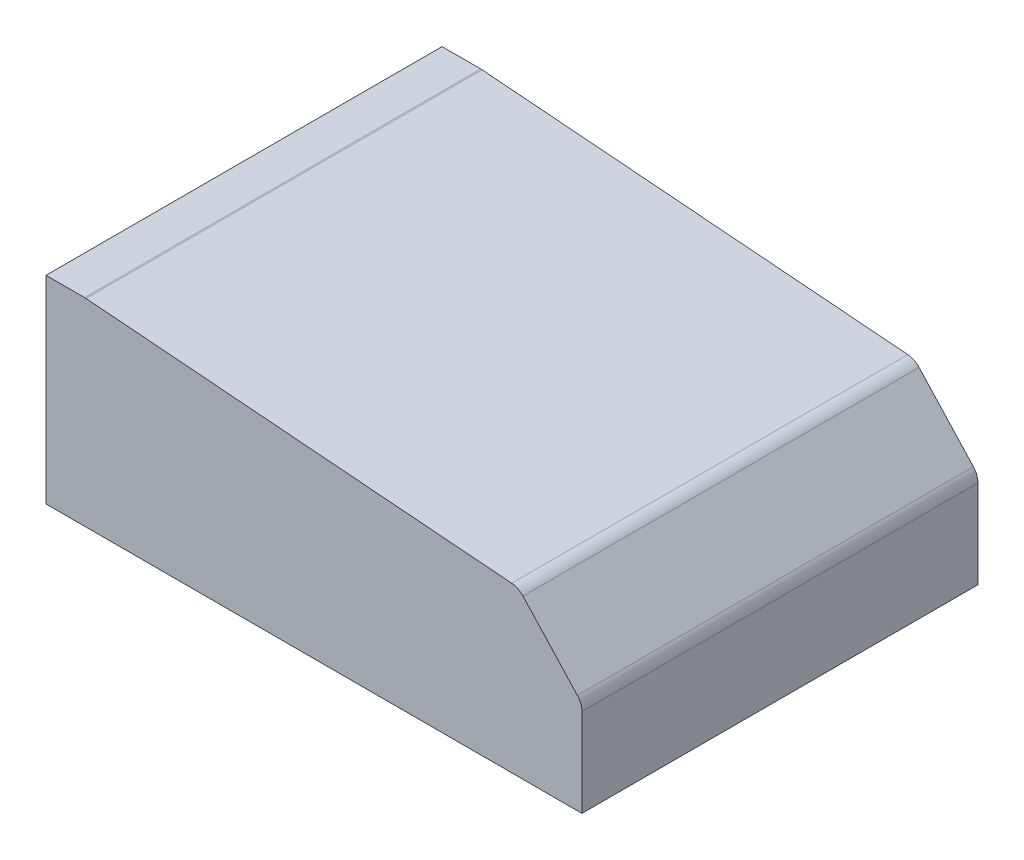
ISO-10303-21;
HEADER;
FILE_DESCRIPTION(('STEP AP214'),'2;1');
FILE_NAME('part.step','',(''),(''),'','','');
FILE_SCHEMA(('AUTOMOTIVE_DESIGN { 1 0 10303 214 1 1 1 1 }'));
ENDSEC;
DATA;
#1=APPLICATION_CONTEXT('core data for automotive mechanical design processes');
#2=APPLICATION_PROTOCOL_DEFINITION('international standard','automotive_design',2000,#1);
#3=PRODUCT_CONTEXT('',#1,'mechanical');
#4=PRODUCT('Part','Part','',(#3));
#5=PRODUCT_RELATED_PRODUCT_CATEGORY('part','',(#4));
#6=PRODUCT_DEFINITION_FORMATION('','',#4);
#7=PRODUCT_DEFINITION_CONTEXT('part definition',#1,'design');
#8=PRODUCT_DEFINITION('design','',#6,#7);
#9=PRODUCT_DEFINITION_SHAPE('','',#8);
#10=(LENGTH_UNIT() NAMED_UNIT(*) SI_UNIT(.MILLI.,.METRE.));
#11=(NAMED_UNIT(*) PLANE_ANGLE_UNIT() SI_UNIT($,.RADIAN.));
#12=(NAMED_UNIT(*) SI_UNIT($,.STERADIAN.) SOLID_ANGLE_UNIT());
#13=UNCERTAINTY_MEASURE_WITH_UNIT(LENGTH_MEASURE(1.E-05),#10,'distance_accuracy_value','');
#14=(GEOMETRIC_REPRESENTATION_CONTEXT(3) GLOBAL_UNCERTAINTY_ASSIGNED_CONTEXT((#13)) GLOBAL_UNIT_ASSIGNED_CONTEXT((#10,
#11,#12)) REPRESENTATION_CONTEXT('',''));
#15=CARTESIAN_POINT('',(0.,0.,0.));
#16=DIRECTION('',(0.,0.,1.));
#17=DIRECTION('',(1.,0.,0.));
#18=AXIS2_PLACEMENT_3D('',#15,#16,#17);
#19=CARTESIAN_POINT('',(0.,0.,504.));
#20=DIRECTION('',(1.,0.,0.));
#21=DIRECTION('',(0.,0.,-1.));
#22=AXIS2_PLACEMENT_3D('',#19,#20,#21);
#23=PLANE('',#22);
#24=DIRECTION('',(0.,-1.,0.));
#25=VECTOR('',#24,1.);
#26=CARTESIAN_POINT('',(0.,0.,2.));
#27=LINE('',#26,#25);
#28=CARTESIAN_POINT('',(0.,250.,2.));
#29=VERTEX_POINT('',#28);
#30=CARTESIAN_POINT('',(0.,0.,2.));
#31=VERTEX_POINT('',#30);
#32=EDGE_CURVE('E229',#29,#31,#27,.T.);
#33=ORIENTED_EDGE('',*,*,#32,.F.);
#34=DIRECTION('',(0.,0.,-1.));
#35=VECTOR('',#34,1.);
#36=CARTESIAN_POINT('',(0.,250.,504.));
#37=LINE('',#36,#35);
#38=CARTESIAN_POINT('',(0.,250.,502.));
#39=VERTEX_POINT('',#38);
#40=EDGE_CURVE('E223',#39,#29,#37,.T.);
#41=ORIENTED_EDGE('',*,*,#40,.F.);
#42=DIRECTION('',(0.,-1.,0.));
#43=VECTOR('',#42,1.);
#44=CARTESIAN_POINT('',(0.,0.,502.));
#45=LINE('',#44,#43);
#46=CARTESIAN_POINT('',(0.,0.,502.));
#47=VERTEX_POINT('',#46);
#48=EDGE_CURVE('E141',#39,#47,#45,.T.);
#49=ORIENTED_EDGE('',*,*,#48,.T.);
#50=DIRECTION('',(0.,0.,-1.));
#51=VECTOR('',#50,1.);
#52=CARTESIAN_POINT('',(0.,0.,504.));
#53=LINE('',#52,#51);
#54=CARTESIAN_POINT('',(0.,0.,504.));
#55=VERTEX_POINT('',#54);
#56=EDGE_CURVE('E136',#55,#47,#53,.T.);
#57=ORIENTED_EDGE('',*,*,#56,.F.);
#58=DIRECTION('',(0.,-1.,0.));
#59=VECTOR('',#58,1.);
#60=CARTESIAN_POINT('',(0.,0.,504.));
#61=LINE('',#60,#59);
#62=CARTESIAN_POINT('',(0.,252.,504.));
#63=VERTEX_POINT('',#62);
#64=EDGE_CURVE('E122',#63,#55,#61,.T.);
#65=ORIENTED_EDGE('',*,*,#64,.F.);
#66=DIRECTION('',(0.,0.,-1.));
#67=VECTOR('',#66,1.);
#68=CARTESIAN_POINT('',(0.,252.,504.));
#69=LINE('',#68,#67);
#70=CARTESIAN_POINT('',(0.,252.,0.));
#71=VERTEX_POINT('',#70);
#72=EDGE_CURVE('E144',#63,#71,#69,.T.);
#73=ORIENTED_EDGE('',*,*,#72,.T.);
#74=DIRECTION('',(0.,-1.,0.));
#75=VECTOR('',#74,1.);
#76=CARTESIAN_POINT('',(0.,0.,0.));
#77=LINE('',#76,#75);
#78=CARTESIAN_POINT('',(0.,0.,0.));
#79=VERTEX_POINT('',#78);
#80=EDGE_CURVE('E169',#71,#79,#77,.T.);
#81=ORIENTED_EDGE('',*,*,#80,.T.);
#82=EDGE_CURVE('E145',#31,#79,#53,.T.);
#83=ORIENTED_EDGE('',*,*,#82,.F.);
#84=EDGE_LOOP('',(#33,#41,#49,#57,#65,#73,#81,#83));
#85=FACE_BOUND('',#84,.T.);
#86=ADVANCED_FACE('F35',(#85),#23,.F.);
#87=CARTESIAN_POINT('',(682.,0.,504.));
#88=DIRECTION('',(0.,1.,0.));
#89=DIRECTION('',(0.,0.,1.));
#90=AXIS2_PLACEMENT_3D('',#87,#88,#89);
#91=PLANE('',#90);
#92=DIRECTION('',(1.,0.,0.));
#93=VECTOR('',#92,1.);
#94=CARTESIAN_POINT('',(682.,0.,2.));
#95=LINE('',#94,#93);
#96=CARTESIAN_POINT('',(680.,0.,2.));
#97=VERTEX_POINT('',#96);
#98=EDGE_CURVE('E225',#31,#97,#95,.T.);
#99=ORIENTED_EDGE('',*,*,#98,.F.);
#100=ORIENTED_EDGE('',*,*,#82,.T.);
#101=DIRECTION('',(1.,0.,0.));
#102=VECTOR('',#101,1.);
#103=CARTESIAN_POINT('',(682.,0.,0.));
#104=LINE('',#103,#102);
#105=CARTESIAN_POINT('',(682.,0.,0.));
#106=VERTEX_POINT('',#105);
#107=EDGE_CURVE('E172',#79,#106,#104,.T.);
#108=ORIENTED_EDGE('',*,*,#107,.T.);
#109=DIRECTION('',(0.,0.,-1.));
#110=VECTOR('',#109,1.);
#111=CARTESIAN_POINT('',(682.,0.,504.));
#112=LINE('',#111,#110);
#113=CARTESIAN_POINT('',(682.,0.,504.));
#114=VERTEX_POINT('',#113);
#115=EDGE_CURVE('E149',#114,#106,#112,.T.);
#116=ORIENTED_EDGE('',*,*,#115,.F.);
#117=DIRECTION('',(1.,0.,0.));
#118=VECTOR('',#117,1.);
#119=CARTESIAN_POINT('',(682.,0.,504.));
#120=LINE('',#119,#118);
#121=EDGE_CURVE('E126',#55,#114,#120,.T.);
#122=ORIENTED_EDGE('',*,*,#121,.F.);
#123=ORIENTED_EDGE('',*,*,#56,.T.);
#124=DIRECTION('',(1.,0.,0.));
#125=VECTOR('',#124,1.);
#126=CARTESIAN_POINT('',(682.,0.,502.));
#127=LINE('',#126,#125);
#128=CARTESIAN_POINT('',(680.,0.,502.));
#129=VERTEX_POINT('',#128);
#130=EDGE_CURVE('E217',#47,#129,#127,.T.);
#131=ORIENTED_EDGE('',*,*,#130,.T.);
#132=DIRECTION('',(0.,0.,-1.));
#133=VECTOR('',#132,1.);
#134=CARTESIAN_POINT('',(680.,0.,504.));
#135=LINE('',#134,#133);
#136=EDGE_CURVE('E220',#129,#97,#135,.T.);
#137=ORIENTED_EDGE('',*,*,#136,.T.);
#138=EDGE_LOOP('',(#99,#100,#108,#116,#122,#123,#131,#137));
#139=FACE_BOUND('',#138,.T.);
#140=ADVANCED_FACE('F148',(#139),#91,.F.);
#141=CARTESIAN_POINT('',(659.999999999999,112.175975199513,504.));
#142=DIRECTION('',(0.,0.,-1.));
#143=DIRECTION('',(-1.,0.,0.));
#144=AXIS2_PLACEMENT_3D('',#141,#142,#143);
#145=CYLINDRICAL_SURFACE('',#144,22.0000000000002);
#146=CARTESIAN_POINT('',(659.999999999999,112.175975199513,0.));
#147=DIRECTION('',(0.,0.,1.));
#148=DIRECTION('',(1.,0.,0.));
#149=AXIS2_PLACEMENT_3D('',#146,#147,#148);
#150=CIRCLE('',#149,22.0000000000002);
#151=CARTESIAN_POINT('',(682.,112.175975199513,0.));
#152=VERTEX_POINT('',#151);
#153=CARTESIAN_POINT('',(676.160164376162,127.104105937667,0.));
#154=VERTEX_POINT('',#153);
#155=EDGE_CURVE('E155',#152,#154,#150,.T.);
#156=ORIENTED_EDGE('',*,*,#155,.T.);
#157=DIRECTION('',(0.,0.,-1.));
#158=VECTOR('',#157,1.);
#159=CARTESIAN_POINT('',(676.160164376162,127.104105937667,504.));
#160=LINE('',#159,#158);
#161=CARTESIAN_POINT('',(676.160164376162,127.104105937667,504.));
#162=VERTEX_POINT('',#161);
#163=EDGE_CURVE('E11',#162,#154,#160,.T.);
#164=ORIENTED_EDGE('',*,*,#163,.F.);
#165=CARTESIAN_POINT('',(659.999999999999,112.175975199513,504.));
#166=DIRECTION('',(0.,0.,1.));
#167=DIRECTION('',(1.,0.,0.));
#168=AXIS2_PLACEMENT_3D('',#165,#166,#167);
#169=CIRCLE('',#168,22.0000000000002);
#170=CARTESIAN_POINT('',(682.,112.175975199513,504.));
#171=VERTEX_POINT('',#170);
#172=EDGE_CURVE('E175',#171,#162,#169,.T.);
#173=ORIENTED_EDGE('',*,*,#172,.F.);
#174=DIRECTION('',(0.,0.,-1.));
#175=VECTOR('',#174,1.);
#176=CARTESIAN_POINT('',(682.,112.175975199513,504.));
#177=LINE('',#176,#175);
#178=EDGE_CURVE('E151',#171,#152,#177,.T.);
#179=ORIENTED_EDGE('',*,*,#178,.T.);
#180=EDGE_LOOP('',(#156,#164,#173,#179));
#181=FACE_BOUND('',#180,.T.);
#182=ADVANCED_FACE('F37',(#181),#145,.T.);
#183=CARTESIAN_POINT('',(676.160164376162,127.104105937667,504.));
#184=DIRECTION('',(-0.734552926189211,-0.678551397188796,0.));
#185=DIRECTION('',(0.678551397188796,-0.734552926189211,0.));
#186=AXIS2_PLACEMENT_3D('',#183,#184,#185);
#187=PLANE('',#186);
#188=DIRECTION('',(-0.678551397188796,0.734552926189211,0.));
#189=VECTOR('',#188,1.);
#190=CARTESIAN_POINT('',(676.160164376162,127.104105937667,0.));
#191=LINE('',#190,#189);
#192=CARTESIAN_POINT('',(607.032660760577,201.936771924876,0.));
#193=VERTEX_POINT('',#192);
#194=EDGE_CURVE('E158',#154,#193,#191,.T.);
#195=ORIENTED_EDGE('',*,*,#194,.T.);
#196=DIRECTION('',(0.,0.,-1.));
#197=VECTOR('',#196,1.);
#198=CARTESIAN_POINT('',(607.032660760577,201.936771924876,504.));
#199=LINE('',#198,#197);
#200=CARTESIAN_POINT('',(607.032660760577,201.936771924876,504.));
#201=VERTEX_POINT('',#200);
#202=EDGE_CURVE('E43',#201,#193,#199,.T.);
#203=ORIENTED_EDGE('',*,*,#202,.F.);
#204=DIRECTION('',(-0.678551397188796,0.734552926189211,0.));
#205=VECTOR('',#204,1.);
#206=CARTESIAN_POINT('',(676.160164376162,127.104105937667,504.));
#207=LINE('',#206,#205);
#208=EDGE_CURVE('E103',#162,#201,#207,.T.);
#209=ORIENTED_EDGE('',*,*,#208,.F.);
#210=ORIENTED_EDGE('',*,*,#163,.T.);
#211=EDGE_LOOP('',(#195,#203,#209,#210));
#212=FACE_BOUND('',#211,.T.);
#213=ADVANCED_FACE('F380',(#212),#187,.F.);
#214=CARTESIAN_POINT('',(590.872496281577,187.008641091726,504.));
#215=DIRECTION('',(0.,0.,-1.));
#216=DIRECTION('',(-1.,0.,0.));
#217=AXIS2_PLACEMENT_3D('',#214,#215,#216);
#218=CYLINDRICAL_SURFACE('',#217,22.0000001399999);
#219=CARTESIAN_POINT('',(590.872496281577,187.008641091726,0.));
#220=DIRECTION('',(0.,0.,1.));
#221=DIRECTION('',(1.,0.,0.));
#222=AXIS2_PLACEMENT_3D('',#219,#220,#221);
#223=CIRCLE('',#222,22.0000001399999);
#224=CARTESIAN_POINT('',(592.613138522907,208.939673232227,0.));
#225=VERTEX_POINT('',#224);
#226=EDGE_CURVE('E161',#193,#225,#223,.T.);
#227=ORIENTED_EDGE('',*,*,#226,.T.);
#228=DIRECTION('',(0.,0.,-1.));
#229=VECTOR('',#228,1.);
#230=CARTESIAN_POINT('',(592.613138522907,208.939673232227,504.));
#231=LINE('',#230,#229);
#232=CARTESIAN_POINT('',(592.613138522907,208.939673232227,504.));
#233=VERTEX_POINT('',#232);
#234=EDGE_CURVE('E185',#233,#225,#231,.T.);
#235=ORIENTED_EDGE('',*,*,#234,.F.);
#236=CARTESIAN_POINT('',(590.872496281577,187.008641091726,504.));
#237=DIRECTION('',(0.,0.,1.));
#238=DIRECTION('',(1.,0.,0.));
#239=AXIS2_PLACEMENT_3D('',#236,#237,#238);
#240=CIRCLE('',#239,22.0000001399999);
#241=EDGE_CURVE('E193',#201,#233,#240,.T.);
#242=ORIENTED_EDGE('',*,*,#241,.F.);
#243=ORIENTED_EDGE('',*,*,#202,.T.);
#244=EDGE_LOOP('',(#227,#235,#242,#243));
#245=FACE_BOUND('',#244,.T.);
#246=ADVANCED_FACE('F191',(#245),#218,.T.);
#247=CARTESIAN_POINT('',(592.613138522907,208.939673232227,504.));
#248=DIRECTION('',(-0.0791201013751532,-0.996865090951823,0.));
#249=DIRECTION('',(0.996865090951823,-0.0791201013751532,0.));
#250=AXIS2_PLACEMENT_3D('',#247,#248,#249);
#251=PLANE('',#250);
#252=DIRECTION('',(-0.996865090951823,0.0791201013751532,0.));
#253=VECTOR('',#252,1.);
#254=CARTESIAN_POINT('',(592.613138522907,208.939673232227,0.));
#255=LINE('',#254,#253);
#256=CARTESIAN_POINT('',(50.9482009999998,251.931032,0.));
#257=VERTEX_POINT('',#256);
#258=EDGE_CURVE('E163',#225,#257,#255,.T.);
#259=ORIENTED_EDGE('',*,*,#258,.T.);
#260=DIRECTION('',(0.,0.,-1.));
#261=VECTOR('',#260,1.);
#262=CARTESIAN_POINT('',(50.9482009999998,251.931032,504.));
#263=LINE('',#262,#261);
#264=CARTESIAN_POINT('',(50.9482009999998,251.931032,504.));
#265=VERTEX_POINT('',#264);
#266=EDGE_CURVE('E182',#265,#257,#263,.T.);
#267=ORIENTED_EDGE('',*,*,#266,.F.);
#268=DIRECTION('',(-0.996865090951823,0.0791201013751532,0.));
#269=VECTOR('',#268,1.);
#270=CARTESIAN_POINT('',(592.613138522907,208.939673232227,504.));
#271=LINE('',#270,#269);
#272=EDGE_CURVE('E209',#233,#265,#271,.T.);
#273=ORIENTED_EDGE('',*,*,#272,.F.);
#274=ORIENTED_EDGE('',*,*,#234,.T.);
#275=EDGE_LOOP('',(#259,#267,#273,#274));
#276=FACE_BOUND('',#275,.T.);
#277=ADVANCED_FACE('F202',(#276),#251,.F.);
#278=CARTESIAN_POINT('',(49.2075587460105,229.999999700001,504.));
#279=DIRECTION('',(0.,0.,-1.));
#280=DIRECTION('',(-1.,0.,0.));
#281=AXIS2_PLACEMENT_3D('',#278,#279,#280);
#282=CYLINDRICAL_SURFACE('',#281,22.0000002999998);
#283=CARTESIAN_POINT('',(49.2075587460105,229.999999700001,0.));
#284=DIRECTION('',(0.,0.,1.));
#285=DIRECTION('',(1.,0.,0.));
#286=AXIS2_PLACEMENT_3D('',#283,#284,#285);
#287=CIRCLE('',#286,22.0000002999998);
#288=CARTESIAN_POINT('',(49.2075587460105,252.,0.));
#289=VERTEX_POINT('',#288);
#290=EDGE_CURVE('E165',#257,#289,#287,.T.);
#291=ORIENTED_EDGE('',*,*,#290,.T.);
#292=DIRECTION('',(0.,0.,-1.));
#293=VECTOR('',#292,1.);
#294=CARTESIAN_POINT('',(49.2075587460105,252.,504.));
#295=LINE('',#294,#293);
#296=CARTESIAN_POINT('',(49.2075587460105,252.,504.));
#297=VERTEX_POINT('',#296);
#298=EDGE_CURVE('E179',#297,#289,#295,.T.);
#299=ORIENTED_EDGE('',*,*,#298,.F.);
#300=CARTESIAN_POINT('',(49.2075587460105,229.999999700001,504.));
#301=DIRECTION('',(0.,0.,1.));
#302=DIRECTION('',(1.,0.,0.));
#303=AXIS2_PLACEMENT_3D('',#300,#301,#302);
#304=CIRCLE('',#303,22.0000002999998);
#305=EDGE_CURVE('E208',#265,#297,#304,.T.);
#306=ORIENTED_EDGE('',*,*,#305,.F.);
#307=ORIENTED_EDGE('',*,*,#266,.T.);
#308=EDGE_LOOP('',(#291,#299,#306,#307));
#309=FACE_BOUND('',#308,.T.);
#310=ADVANCED_FACE('F206',(#309),#282,.T.);
#311=CARTESIAN_POINT('',(49.2075587460105,252.,504.));
#312=DIRECTION('',(0.,-1.,0.));
#313=DIRECTION('',(0.,0.,-1.));
#314=AXIS2_PLACEMENT_3D('',#311,#312,#313);
#315=PLANE('',#314);
#316=DIRECTION('',(-1.,0.,0.));
#317=VECTOR('',#316,1.);
#318=CARTESIAN_POINT('',(49.2075587460105,252.,0.));
#319=LINE('',#318,#317);
#320=EDGE_CURVE('E167',#289,#71,#319,.T.);
#321=ORIENTED_EDGE('',*,*,#320,.T.);
#322=ORIENTED_EDGE('',*,*,#72,.F.);
#323=DIRECTION('',(-1.,0.,0.));
#324=VECTOR('',#323,1.);
#325=CARTESIAN_POINT('',(49.2075587460105,252.,504.));
#326=LINE('',#325,#324);
#327=EDGE_CURVE('E129',#297,#63,#326,.T.);
#328=ORIENTED_EDGE('',*,*,#327,.F.);
#329=ORIENTED_EDGE('',*,*,#298,.T.);
#330=EDGE_LOOP('',(#321,#322,#328,#329));
#331=FACE_BOUND('',#330,.T.);
#332=ADVANCED_FACE('F370',(#331),#315,.F.);
#333=CARTESIAN_POINT('',(682.,0.,504.));
#334=DIRECTION('',(-1.,0.,0.));
#335=DIRECTION('',(0.,0.,1.));
#336=AXIS2_PLACEMENT_3D('',#333,#334,#335);
#337=PLANE('',#336);
#338=DIRECTION('',(0.,1.,0.));
#339=VECTOR('',#338,1.);
#340=CARTESIAN_POINT('',(682.,0.,0.));
#341=LINE('',#340,#339);
#342=EDGE_CURVE('E95',#106,#152,#341,.T.);
#343=ORIENTED_EDGE('',*,*,#342,.T.);
#344=ORIENTED_EDGE('',*,*,#178,.F.);
#345=DIRECTION('',(0.,1.,0.));
#346=VECTOR('',#345,1.);
#347=CARTESIAN_POINT('',(682.,0.,504.));
#348=LINE('',#347,#346);
#349=EDGE_CURVE('E59',#114,#171,#348,.T.);
#350=ORIENTED_EDGE('',*,*,#349,.F.);
#351=ORIENTED_EDGE('',*,*,#115,.T.);
#352=EDGE_LOOP('',(#343,#344,#350,#351));
#353=FACE_BOUND('',#352,.T.);
#354=ADVANCED_FACE('F373',(#353),#337,.F.);
#355=CARTESIAN_POINT('',(659.999999999999,112.175975199513,504.));
#356=DIRECTION('',(0.,0.,1.));
#357=DIRECTION('',(1.,0.,0.));
#358=AXIS2_PLACEMENT_3D('',#355,#356,#357);
#359=PLANE('',#358);
#360=ORIENTED_EDGE('',*,*,#172,.T.);
#361=ORIENTED_EDGE('',*,*,#208,.T.);
#362=ORIENTED_EDGE('',*,*,#241,.T.);
#363=ORIENTED_EDGE('',*,*,#272,.T.);
#364=ORIENTED_EDGE('',*,*,#305,.T.);
#365=ORIENTED_EDGE('',*,*,#327,.T.);
#366=ORIENTED_EDGE('',*,*,#64,.T.);
#367=ORIENTED_EDGE('',*,*,#121,.T.);
#368=ORIENTED_EDGE('',*,*,#349,.T.);
#369=EDGE_LOOP('',(#360,#361,#362,#363,#364,#365,#366,#367,#368));
#370=FACE_BOUND('',#369,.T.);
#371=ADVANCED_FACE('F124',(#370),#359,.T.);
#372=CARTESIAN_POINT('',(659.999999999999,112.175975199513,0.));
#373=DIRECTION('',(0.,0.,1.));
#374=DIRECTION('',(1.,0.,0.));
#375=AXIS2_PLACEMENT_3D('',#372,#373,#374);
#376=PLANE('',#375);
#377=ORIENTED_EDGE('',*,*,#155,.F.);
#378=ORIENTED_EDGE('',*,*,#342,.F.);
#379=ORIENTED_EDGE('',*,*,#107,.F.);
#380=ORIENTED_EDGE('',*,*,#80,.F.);
#381=ORIENTED_EDGE('',*,*,#320,.F.);
#382=ORIENTED_EDGE('',*,*,#290,.F.);
#383=ORIENTED_EDGE('',*,*,#258,.F.);
#384=ORIENTED_EDGE('',*,*,#226,.F.);
#385=ORIENTED_EDGE('',*,*,#194,.F.);
#386=EDGE_LOOP('',(#377,#378,#379,#380,#381,#382,#383,#384,#385));
#387=FACE_BOUND('',#386,.T.);
#388=ADVANCED_FACE('F197',(#387),#376,.F.);
#389=CARTESIAN_POINT('',(659.999999999999,112.175975199513,504.));
#390=DIRECTION('',(0.,0.,-1.));
#391=DIRECTION('',(-1.,0.,0.));
#392=AXIS2_PLACEMENT_3D('',#389,#390,#391);
#393=CYLINDRICAL_SURFACE('',#392,20.0000000000002);
#394=CARTESIAN_POINT('',(659.999999999999,112.175975199513,2.));
#395=DIRECTION('',(0.,0.,1.));
#396=DIRECTION('',(1.,0.,0.));
#397=AXIS2_PLACEMENT_3D('',#394,#395,#396);
#398=CIRCLE('',#397,20.0000000000002);
#399=CARTESIAN_POINT('',(680.,112.175975199513,2.));
#400=VERTEX_POINT('',#399);
#401=CARTESIAN_POINT('',(674.691058523784,125.74700314329,2.));
#402=VERTEX_POINT('',#401);
#403=EDGE_CURVE('E279',#400,#402,#398,.T.);
#404=ORIENTED_EDGE('',*,*,#403,.F.);
#405=DIRECTION('',(0.,0.,-1.));
#406=VECTOR('',#405,1.);
#407=CARTESIAN_POINT('',(680.,112.175975199513,504.));
#408=LINE('',#407,#406);
#409=CARTESIAN_POINT('',(680.,112.175975199513,502.));
#410=VERTEX_POINT('',#409);
#411=EDGE_CURVE('E224',#410,#400,#408,.T.);
#412=ORIENTED_EDGE('',*,*,#411,.F.);
#413=CARTESIAN_POINT('',(659.999999999999,112.175975199513,502.));
#414=DIRECTION('',(0.,0.,1.));
#415=DIRECTION('',(1.,0.,0.));
#416=AXIS2_PLACEMENT_3D('',#413,#414,#415);
#417=CIRCLE('',#416,20.0000000000002);
#418=CARTESIAN_POINT('',(674.691058523784,125.74700314329,502.));
#419=VERTEX_POINT('',#418);
#420=EDGE_CURVE('E238',#410,#419,#417,.T.);
#421=ORIENTED_EDGE('',*,*,#420,.T.);
#422=DIRECTION('',(0.,0.,1.));
#423=VECTOR('',#422,1.);
#424=CARTESIAN_POINT('',(674.691058523784,125.74700314329,504.));
#425=LINE('',#424,#423);
#426=EDGE_CURVE('E159',#419,#402,#425,.F.);
#427=ORIENTED_EDGE('',*,*,#426,.T.);
#428=EDGE_LOOP('',(#404,#412,#421,#427));
#429=FACE_BOUND('',#428,.T.);
#430=ADVANCED_FACE('F298',(#429),#393,.F.);
#431=CARTESIAN_POINT('',(674.691058523784,125.74700314329,504.));
#432=DIRECTION('',(-0.734552926189211,-0.678551397188796,0.));
#433=DIRECTION('',(0.678551397188796,-0.734552926189211,0.));
#434=AXIS2_PLACEMENT_3D('',#431,#432,#433);
#435=PLANE('',#434);
#436=DIRECTION('',(-0.678551397188796,0.734552926189211,0.));
#437=VECTOR('',#436,1.);
#438=CARTESIAN_POINT('',(674.691058523784,125.74700314329,2.));
#439=LINE('',#438,#437);
#440=CARTESIAN_POINT('',(605.563554908199,200.579669130499,2.));
#441=VERTEX_POINT('',#440);
#442=EDGE_CURVE('E272',#402,#441,#439,.T.);
#443=ORIENTED_EDGE('',*,*,#442,.F.);
#444=ORIENTED_EDGE('',*,*,#426,.F.);
#445=DIRECTION('',(-0.678551397188796,0.734552926189211,0.));
#446=VECTOR('',#445,1.);
#447=CARTESIAN_POINT('',(674.691058523784,125.74700314329,502.));
#448=LINE('',#447,#446);
#449=CARTESIAN_POINT('',(605.563554908199,200.579669130499,502.));
#450=VERTEX_POINT('',#449);
#451=EDGE_CURVE('E266',#419,#450,#448,.T.);
#452=ORIENTED_EDGE('',*,*,#451,.T.);
#453=DIRECTION('',(0.,0.,-1.));
#454=VECTOR('',#453,1.);
#455=CARTESIAN_POINT('',(605.563554908199,200.579669130499,504.));
#456=LINE('',#455,#454);
#457=EDGE_CURVE('E269',#450,#441,#456,.T.);
#458=ORIENTED_EDGE('',*,*,#457,.T.);
#459=EDGE_LOOP('',(#443,#444,#452,#458));
#460=FACE_BOUND('',#459,.T.);
#461=ADVANCED_FACE('F334',(#460),#435,.T.);
#462=CARTESIAN_POINT('',(590.872496281577,187.008641091726,504.));
#463=DIRECTION('',(0.,0.,-1.));
#464=DIRECTION('',(-1.,0.,0.));
#465=AXIS2_PLACEMENT_3D('',#462,#463,#464);
#466=CYLINDRICAL_SURFACE('',#465,20.0000001399999);
#467=CARTESIAN_POINT('',(590.872496281577,187.008641091726,2.));
#468=DIRECTION('',(0.,0.,1.));
#469=DIRECTION('',(1.,0.,0.));
#470=AXIS2_PLACEMENT_3D('',#467,#468,#469);
#471=CIRCLE('',#470,20.0000001399999);
#472=CARTESIAN_POINT('',(592.454898320157,206.945943050324,2.));
#473=VERTEX_POINT('',#472);
#474=EDGE_CURVE('E263',#441,#473,#471,.T.);
#475=ORIENTED_EDGE('',*,*,#474,.F.);
#476=ORIENTED_EDGE('',*,*,#457,.F.);
#477=CARTESIAN_POINT('',(590.872496281577,187.008641091726,502.));
#478=DIRECTION('',(0.,0.,1.));
#479=DIRECTION('',(1.,0.,0.));
#480=AXIS2_PLACEMENT_3D('',#477,#478,#479);
#481=CIRCLE('',#480,20.0000001399999);
#482=CARTESIAN_POINT('',(592.454898320157,206.945943050324,502.));
#483=VERTEX_POINT('',#482);
#484=EDGE_CURVE('E257',#450,#483,#481,.T.);
#485=ORIENTED_EDGE('',*,*,#484,.T.);
#486=DIRECTION('',(0.,0.,1.));
#487=VECTOR('',#486,1.);
#488=CARTESIAN_POINT('',(592.454898320157,206.945943050324,504.));
#489=LINE('',#488,#487);
#490=EDGE_CURVE('E260',#483,#473,#489,.F.);
#491=ORIENTED_EDGE('',*,*,#490,.T.);
#492=EDGE_LOOP('',(#475,#476,#485,#491));
#493=FACE_BOUND('',#492,.T.);
#494=ADVANCED_FACE('F338',(#493),#466,.F.);
#495=CARTESIAN_POINT('',(592.454898320157,206.945943050324,504.));
#496=DIRECTION('',(-0.0791201013751532,-0.996865090951823,0.));
#497=DIRECTION('',(0.996865090951823,-0.0791201013751532,0.));
#498=AXIS2_PLACEMENT_3D('',#495,#496,#497);
#499=PLANE('',#498);
#500=DIRECTION('',(-0.996865090951823,0.0791201013751532,0.));
#501=VECTOR('',#500,1.);
#502=CARTESIAN_POINT('',(592.454898320157,206.945943050324,2.));
#503=LINE('',#502,#501);
#504=CARTESIAN_POINT('',(50.7899607972495,249.937301818096,2.));
#505=VERTEX_POINT('',#504);
#506=EDGE_CURVE('E254',#473,#505,#503,.T.);
#507=ORIENTED_EDGE('',*,*,#506,.F.);
#508=ORIENTED_EDGE('',*,*,#490,.F.);
#509=DIRECTION('',(-0.996865090951823,0.0791201013751532,0.));
#510=VECTOR('',#509,1.);
#511=CARTESIAN_POINT('',(592.454898320157,206.945943050324,502.));
#512=LINE('',#511,#510);
#513=CARTESIAN_POINT('',(50.7899607972495,249.937301818096,502.));
#514=VERTEX_POINT('',#513);
#515=EDGE_CURVE('E248',#483,#514,#512,.T.);
#516=ORIENTED_EDGE('',*,*,#515,.T.);
#517=DIRECTION('',(0.,0.,-1.));
#518=VECTOR('',#517,1.);
#519=CARTESIAN_POINT('',(50.7899607972495,249.937301818096,504.));
#520=LINE('',#519,#518);
#521=EDGE_CURVE('E251',#514,#505,#520,.T.);
#522=ORIENTED_EDGE('',*,*,#521,.T.);
#523=EDGE_LOOP('',(#507,#508,#516,#522));
#524=FACE_BOUND('',#523,.T.);
#525=ADVANCED_FACE('F344',(#524),#499,.T.);
#526=CARTESIAN_POINT('',(49.2075587460105,229.999999700001,504.));
#527=DIRECTION('',(0.,0.,-1.));
#528=DIRECTION('',(-1.,0.,0.));
#529=AXIS2_PLACEMENT_3D('',#526,#527,#528);
#530=CYLINDRICAL_SURFACE('',#529,20.0000002999998);
#531=CARTESIAN_POINT('',(49.2075587460105,229.999999700001,2.));
#532=DIRECTION('',(0.,0.,1.));
#533=DIRECTION('',(1.,0.,0.));
#534=AXIS2_PLACEMENT_3D('',#531,#532,#533);
#535=CIRCLE('',#534,20.0000002999998);
#536=CARTESIAN_POINT('',(49.2075587460105,250.,2.));
#537=VERTEX_POINT('',#536);
#538=EDGE_CURVE('E245',#505,#537,#535,.T.);
#539=ORIENTED_EDGE('',*,*,#538,.F.);
#540=ORIENTED_EDGE('',*,*,#521,.F.);
#541=CARTESIAN_POINT('',(49.2075587460105,229.999999700001,502.));
#542=DIRECTION('',(0.,0.,1.));
#543=DIRECTION('',(1.,0.,0.));
#544=AXIS2_PLACEMENT_3D('',#541,#542,#543);
#545=CIRCLE('',#544,20.0000002999998);
#546=CARTESIAN_POINT('',(49.2075587460105,250.,502.));
#547=VERTEX_POINT('',#546);
#548=EDGE_CURVE('E242',#514,#547,#545,.T.);
#549=ORIENTED_EDGE('',*,*,#548,.T.);
#550=DIRECTION('',(0.,0.,-1.));
#551=VECTOR('',#550,1.);
#552=CARTESIAN_POINT('',(49.2075587460105,250.,504.));
#553=LINE('',#552,#551);
#554=EDGE_CURVE('E235',#547,#537,#553,.T.);
#555=ORIENTED_EDGE('',*,*,#554,.T.);
#556=EDGE_LOOP('',(#539,#540,#549,#555));
#557=FACE_BOUND('',#556,.T.);
#558=ADVANCED_FACE('F346',(#557),#530,.F.);
#559=CARTESIAN_POINT('',(49.2075587460105,250.,504.));
#560=DIRECTION('',(0.,-1.,0.));
#561=DIRECTION('',(0.,0.,-1.));
#562=AXIS2_PLACEMENT_3D('',#559,#560,#561);
#563=PLANE('',#562);
#564=DIRECTION('',(-1.,0.,0.));
#565=VECTOR('',#564,1.);
#566=CARTESIAN_POINT('',(49.2075587460105,250.,2.));
#567=LINE('',#566,#565);
#568=EDGE_CURVE('E232',#537,#29,#567,.T.);
#569=ORIENTED_EDGE('',*,*,#568,.F.);
#570=ORIENTED_EDGE('',*,*,#554,.F.);
#571=DIRECTION('',(-1.,0.,0.));
#572=VECTOR('',#571,1.);
#573=CARTESIAN_POINT('',(49.2075587460105,250.,502.));
#574=LINE('',#573,#572);
#575=EDGE_CURVE('E218',#547,#39,#574,.T.);
#576=ORIENTED_EDGE('',*,*,#575,.T.);
#577=ORIENTED_EDGE('',*,*,#40,.T.);
#578=EDGE_LOOP('',(#569,#570,#576,#577));
#579=FACE_BOUND('',#578,.T.);
#580=ADVANCED_FACE('F348',(#579),#563,.T.);
#581=CARTESIAN_POINT('',(680.,0.,504.));
#582=DIRECTION('',(-1.,0.,0.));
#583=DIRECTION('',(0.,0.,1.));
#584=AXIS2_PLACEMENT_3D('',#581,#582,#583);
#585=PLANE('',#584);
#586=DIRECTION('',(0.,1.,0.));
#587=VECTOR('',#586,1.);
#588=CARTESIAN_POINT('',(680.,0.,2.));
#589=LINE('',#588,#587);
#590=EDGE_CURVE('E228',#97,#400,#589,.T.);
#591=ORIENTED_EDGE('',*,*,#590,.F.);
#592=ORIENTED_EDGE('',*,*,#136,.F.);
#593=DIRECTION('',(0.,1.,0.));
#594=VECTOR('',#593,1.);
#595=CARTESIAN_POINT('',(680.,0.,502.));
#596=LINE('',#595,#594);
#597=EDGE_CURVE('E50',#129,#410,#596,.T.);
#598=ORIENTED_EDGE('',*,*,#597,.T.);
#599=ORIENTED_EDGE('',*,*,#411,.T.);
#600=EDGE_LOOP('',(#591,#592,#598,#599));
#601=FACE_BOUND('',#600,.T.);
#602=ADVANCED_FACE('F353',(#601),#585,.T.);
#603=CARTESIAN_POINT('',(659.999999999999,112.175975199513,502.));
#604=DIRECTION('',(0.,0.,1.));
#605=DIRECTION('',(1.,0.,0.));
#606=AXIS2_PLACEMENT_3D('',#603,#604,#605);
#607=PLANE('',#606);
#608=ORIENTED_EDGE('',*,*,#420,.F.);
#609=ORIENTED_EDGE('',*,*,#597,.F.);
#610=ORIENTED_EDGE('',*,*,#130,.F.);
#611=ORIENTED_EDGE('',*,*,#48,.F.);
#612=ORIENTED_EDGE('',*,*,#575,.F.);
#613=ORIENTED_EDGE('',*,*,#548,.F.);
#614=ORIENTED_EDGE('',*,*,#515,.F.);
#615=ORIENTED_EDGE('',*,*,#484,.F.);
#616=ORIENTED_EDGE('',*,*,#451,.F.);
#617=EDGE_LOOP('',(#608,#609,#610,#611,#612,#613,#614,#615,#616));
#618=FACE_BOUND('',#617,.T.);
#619=ADVANCED_FACE('F341',(#618),#607,.F.);
#620=CARTESIAN_POINT('',(659.999999999999,112.175975199513,2.));
#621=DIRECTION('',(0.,0.,1.));
#622=DIRECTION('',(1.,0.,0.));
#623=AXIS2_PLACEMENT_3D('',#620,#621,#622);
#624=PLANE('',#623);
#625=ORIENTED_EDGE('',*,*,#403,.T.);
#626=ORIENTED_EDGE('',*,*,#442,.T.);
#627=ORIENTED_EDGE('',*,*,#474,.T.);
#628=ORIENTED_EDGE('',*,*,#506,.T.);
#629=ORIENTED_EDGE('',*,*,#538,.T.);
#630=ORIENTED_EDGE('',*,*,#568,.T.);
#631=ORIENTED_EDGE('',*,*,#32,.T.);
#632=ORIENTED_EDGE('',*,*,#98,.T.);
#633=ORIENTED_EDGE('',*,*,#590,.T.);
#634=EDGE_LOOP('',(#625,#626,#627,#628,#629,#630,#631,#632,#633));
#635=FACE_BOUND('',#634,.T.);
#636=ADVANCED_FACE('F290',(#635),#624,.T.);
#637=CLOSED_SHELL('',(#86,#140,#182,#213,#246,#277,#310,#332,#354,#371,#388,#430,#461,#494,#525,
#558,#580,#602,#619,#636));
#638=MANIFOLD_SOLID_BREP('B2',#637);
#639=ADVANCED_BREP_SHAPE_REPRESENTATION('',(#18,#638),#14);
#640=SHAPE_DEFINITION_REPRESENTATION(#9,#639);
ENDSEC;
END-ISO-10303-21;
